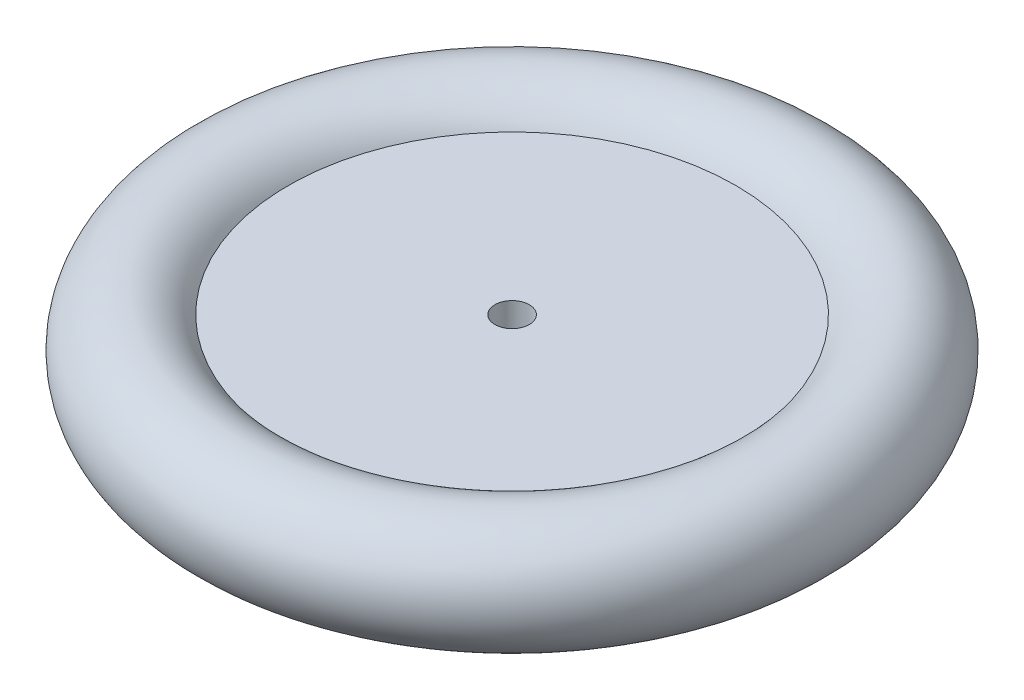
ISO-10303-21;
HEADER;
FILE_DESCRIPTION(('STEP AP214'),'2;1');
FILE_NAME('part.step','',(''),(''),'','','');
FILE_SCHEMA(('AUTOMOTIVE_DESIGN { 1 0 10303 214 1 1 1 1 }'));
ENDSEC;
DATA;
#1=APPLICATION_CONTEXT('core data for automotive mechanical design processes');
#2=APPLICATION_PROTOCOL_DEFINITION('international standard','automotive_design',2000,#1);
#3=PRODUCT_CONTEXT('',#1,'mechanical');
#4=PRODUCT('Part','Part','',(#3));
#5=PRODUCT_RELATED_PRODUCT_CATEGORY('part','',(#4));
#6=PRODUCT_DEFINITION_FORMATION('','',#4);
#7=PRODUCT_DEFINITION_CONTEXT('part definition',#1,'design');
#8=PRODUCT_DEFINITION('design','',#6,#7);
#9=PRODUCT_DEFINITION_SHAPE('','',#8);
#10=(LENGTH_UNIT() NAMED_UNIT(*) SI_UNIT(.MILLI.,.METRE.));
#11=(NAMED_UNIT(*) PLANE_ANGLE_UNIT() SI_UNIT($,.RADIAN.));
#12=(NAMED_UNIT(*) SI_UNIT($,.STERADIAN.) SOLID_ANGLE_UNIT());
#13=UNCERTAINTY_MEASURE_WITH_UNIT(LENGTH_MEASURE(1.E-05),#10,'distance_accuracy_value','');
#14=(GEOMETRIC_REPRESENTATION_CONTEXT(3) GLOBAL_UNCERTAINTY_ASSIGNED_CONTEXT((#13)) GLOBAL_UNIT_ASSIGNED_CONTEXT((#10,
#11,#12)) REPRESENTATION_CONTEXT('',''));
#15=CARTESIAN_POINT('',(0.,0.,0.));
#16=DIRECTION('',(0.,0.,1.));
#17=DIRECTION('',(1.,0.,0.));
#18=AXIS2_PLACEMENT_3D('',#15,#16,#17);
#19=CARTESIAN_POINT('',(0.,0.33153249177637,0.));
#20=DIRECTION('',(0.,-1.,0.));
#21=DIRECTION('',(0.,0.,-1.));
#22=AXIS2_PLACEMENT_3D('',#19,#20,#21);
#23=TOROIDAL_SURFACE('',#22,23.7283899013164,5.);
#24=CARTESIAN_POINT('',(0.,3.,0.));
#25=DIRECTION('',(0.,-1.,0.));
#26=DIRECTION('',(0.,0.,-1.));
#27=AXIS2_PLACEMENT_3D('',#24,#25,#26);
#28=CIRCLE('',#27,19.5);
#29=CARTESIAN_POINT('',(0.,3.,-19.5));
#30=VERTEX_POINT('',#29);
#31=EDGE_CURVE('E10',#30,#30,#28,.T.);
#32=ORIENTED_EDGE('',*,*,#31,.T.);
#33=EDGE_LOOP('',(#32));
#34=FACE_BOUND('',#33,.T.);
#35=CARTESIAN_POINT('',(0.,-3.,0.));
#36=DIRECTION('',(0.,-1.,0.));
#37=DIRECTION('',(0.,0.,-1.));
#38=AXIS2_PLACEMENT_3D('',#35,#36,#37);
#39=CIRCLE('',#38,20.);
#40=CARTESIAN_POINT('',(0.,-3.,-20.));
#41=VERTEX_POINT('',#40);
#42=EDGE_CURVE('E49',#41,#41,#39,.T.);
#43=ORIENTED_EDGE('',*,*,#42,.F.);
#44=EDGE_LOOP('',(#43));
#45=FACE_BOUND('',#44,.T.);
#46=ADVANCED_FACE('F35',(#34,#45),#23,.T.);
#47=CARTESIAN_POINT('',(1.5,3.,0.));
#48=DIRECTION('',(0.,1.,0.));
#49=DIRECTION('',(0.,0.,1.));
#50=AXIS2_PLACEMENT_3D('',#47,#48,#49);
#51=PLANE('',#50);
#52=CARTESIAN_POINT('',(0.,3.,0.));
#53=DIRECTION('',(0.,-1.,0.));
#54=DIRECTION('',(0.,0.,-1.));
#55=AXIS2_PLACEMENT_3D('',#52,#53,#54);
#56=CIRCLE('',#55,1.5);
#57=CARTESIAN_POINT('',(0.,3.,-1.5));
#58=VERTEX_POINT('',#57);
#59=EDGE_CURVE('E41',#58,#58,#56,.T.);
#60=ORIENTED_EDGE('',*,*,#59,.T.);
#61=EDGE_LOOP('',(#60));
#62=FACE_BOUND('',#61,.T.);
#63=ORIENTED_EDGE('',*,*,#31,.F.);
#64=EDGE_LOOP('',(#63));
#65=FACE_BOUND('',#64,.T.);
#66=ADVANCED_FACE('F59',(#62,#65),#51,.T.);
#67=CARTESIAN_POINT('',(0.,0.,0.));
#68=DIRECTION('',(0.,-1.,0.));
#69=DIRECTION('',(0.,0.,-1.));
#70=AXIS2_PLACEMENT_3D('',#67,#68,#69);
#71=CYLINDRICAL_SURFACE('',#70,1.5);
#72=CARTESIAN_POINT('',(0.,-3.,0.));
#73=DIRECTION('',(0.,-1.,0.));
#74=DIRECTION('',(0.,0.,-1.));
#75=AXIS2_PLACEMENT_3D('',#72,#73,#74);
#76=CIRCLE('',#75,1.5);
#77=CARTESIAN_POINT('',(0.,-3.,-1.5));
#78=VERTEX_POINT('',#77);
#79=EDGE_CURVE('E45',#78,#78,#76,.T.);
#80=ORIENTED_EDGE('',*,*,#79,.T.);
#81=EDGE_LOOP('',(#80));
#82=FACE_BOUND('',#81,.T.);
#83=ORIENTED_EDGE('',*,*,#59,.F.);
#84=EDGE_LOOP('',(#83));
#85=FACE_BOUND('',#84,.T.);
#86=ADVANCED_FACE('F63',(#82,#85),#71,.F.);
#87=CARTESIAN_POINT('',(1.5,-3.,0.));
#88=DIRECTION('',(0.,-1.,0.));
#89=DIRECTION('',(0.,0.,-1.));
#90=AXIS2_PLACEMENT_3D('',#87,#88,#89);
#91=PLANE('',#90);
#92=ORIENTED_EDGE('',*,*,#42,.T.);
#93=EDGE_LOOP('',(#92));
#94=FACE_BOUND('',#93,.T.);
#95=ORIENTED_EDGE('',*,*,#79,.F.);
#96=EDGE_LOOP('',(#95));
#97=FACE_BOUND('',#96,.T.);
#98=ADVANCED_FACE('F55',(#94,#97),#91,.T.);
#99=CLOSED_SHELL('',(#46,#66,#86,#98));
#100=MANIFOLD_SOLID_BREP('B2',#99);
#101=ADVANCED_BREP_SHAPE_REPRESENTATION('',(#18,#100),#14);
#102=SHAPE_DEFINITION_REPRESENTATION(#9,#101);
ENDSEC;
END-ISO-10303-21;
